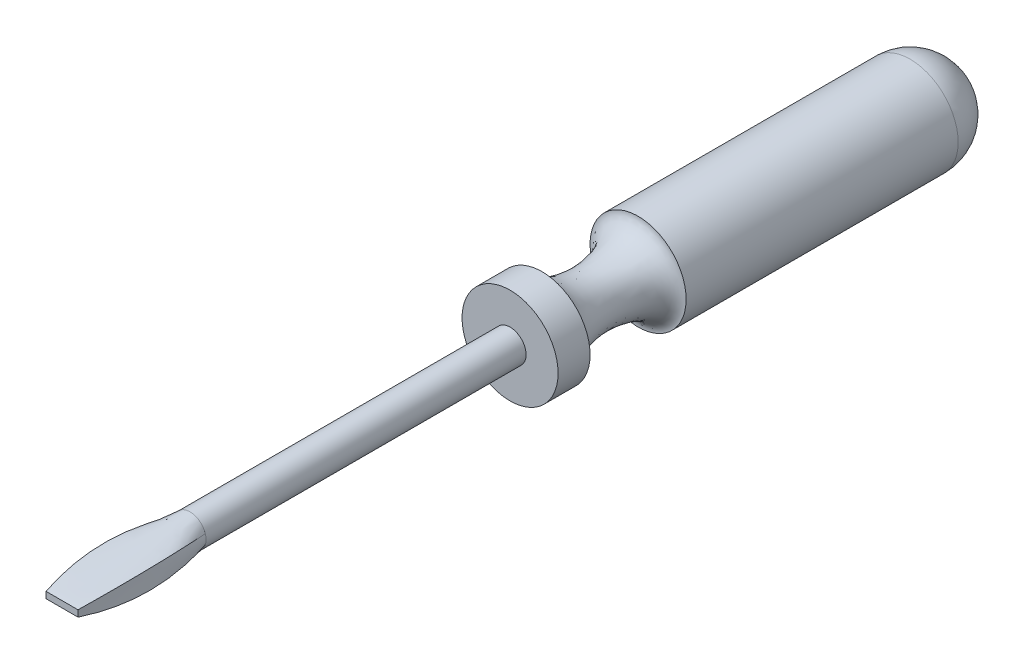
ISO-10303-21;
HEADER;
FILE_DESCRIPTION(('STEP AP214'),'2;1');
FILE_NAME('part.step','',(''),(''),'','','');
FILE_SCHEMA(('AUTOMOTIVE_DESIGN { 1 0 10303 214 1 1 1 1 }'));
ENDSEC;
DATA;
#1=APPLICATION_CONTEXT('core data for automotive mechanical design processes');
#2=APPLICATION_PROTOCOL_DEFINITION('international standard','automotive_design',2000,#1);
#3=PRODUCT_CONTEXT('',#1,'mechanical');
#4=PRODUCT('Part','Part','',(#3));
#5=PRODUCT_RELATED_PRODUCT_CATEGORY('part','',(#4));
#6=PRODUCT_DEFINITION_FORMATION('','',#4);
#7=PRODUCT_DEFINITION_CONTEXT('part definition',#1,'design');
#8=PRODUCT_DEFINITION('design','',#6,#7);
#9=PRODUCT_DEFINITION_SHAPE('','',#8);
#10=(LENGTH_UNIT() NAMED_UNIT(*) SI_UNIT(.MILLI.,.METRE.));
#11=(NAMED_UNIT(*) PLANE_ANGLE_UNIT() SI_UNIT($,.RADIAN.));
#12=(NAMED_UNIT(*) SI_UNIT($,.STERADIAN.) SOLID_ANGLE_UNIT());
#13=UNCERTAINTY_MEASURE_WITH_UNIT(LENGTH_MEASURE(1.E-05),#10,'distance_accuracy_value','');
#14=(GEOMETRIC_REPRESENTATION_CONTEXT(3) GLOBAL_UNCERTAINTY_ASSIGNED_CONTEXT((#13)) GLOBAL_UNIT_ASSIGNED_CONTEXT((#10,
#11,#12)) REPRESENTATION_CONTEXT('',''));
#15=CARTESIAN_POINT('',(0.,0.,0.));
#16=DIRECTION('',(0.,0.,1.));
#17=DIRECTION('',(1.,0.,0.));
#18=AXIS2_PLACEMENT_3D('',#15,#16,#17);
#19=CARTESIAN_POINT('',(0.,0.,0.));
#20=DIRECTION('',(0.,0.,1.));
#21=DIRECTION('',(1.,0.,0.));
#22=AXIS2_PLACEMENT_3D('',#19,#20,#21);
#23=PLANE('',#22);
#24=DIRECTION('',(0.,1.,0.));
#25=VECTOR('',#24,1.);
#26=CARTESIAN_POINT('',(6.35,1.27,0.));
#27=LINE('',#26,#25);
#28=CARTESIAN_POINT('',(6.35,-1.27,0.));
#29=VERTEX_POINT('',#28);
#30=CARTESIAN_POINT('',(6.35,1.27,0.));
#31=VERTEX_POINT('',#30);
#32=EDGE_CURVE('E214',#29,#31,#27,.T.);
#33=ORIENTED_EDGE('',*,*,#32,.T.);
#34=DIRECTION('',(-1.,0.,0.));
#35=VECTOR('',#34,1.);
#36=CARTESIAN_POINT('',(-6.35,1.27,0.));
#37=LINE('',#36,#35);
#38=CARTESIAN_POINT('',(-6.35,1.27,0.));
#39=VERTEX_POINT('',#38);
#40=EDGE_CURVE('E203',#31,#39,#37,.T.);
#41=ORIENTED_EDGE('',*,*,#40,.T.);
#42=DIRECTION('',(0.,-1.,0.));
#43=VECTOR('',#42,1.);
#44=CARTESIAN_POINT('',(-6.35,1.27,0.));
#45=LINE('',#44,#43);
#46=CARTESIAN_POINT('',(-6.35,-1.27,0.));
#47=VERTEX_POINT('',#46);
#48=EDGE_CURVE('E185',#39,#47,#45,.T.);
#49=ORIENTED_EDGE('',*,*,#48,.T.);
#50=DIRECTION('',(1.,0.,0.));
#51=VECTOR('',#50,1.);
#52=CARTESIAN_POINT('',(-6.35,-1.27,0.));
#53=LINE('',#52,#51);
#54=EDGE_CURVE('E296',#47,#29,#53,.T.);
#55=ORIENTED_EDGE('',*,*,#54,.T.);
#56=EDGE_LOOP('',(#33,#41,#49,#55));
#57=FACE_BOUND('',#56,.T.);
#58=ADVANCED_FACE('F119',(#57),#23,.T.);
#59=CARTESIAN_POINT('',(6.35,1.27,0.));
#60=CARTESIAN_POINT('',(8.09098283937438,2.86103718490474,-8.46270798454288));
#61=CARTESIAN_POINT('',(9.78431553948999,4.55437215944736,-25.3961706986833));
#62=CARTESIAN_POINT('',(7.90047388974248,3.27003054932142,-42.3293746512096));
#63=CARTESIAN_POINT('',(6.06423657555215,1.88349004662501,-50.8));
#64=CARTESIAN_POINT('',(6.35,0.423333333333333,0.));
#65=CARTESIAN_POINT('',(8.09098283937438,0.953679061634915,-8.46270798454288));
#66=CARTESIAN_POINT('',(9.59372399025767,1.50364915448665,-25.3961706986833));
#67=CARTESIAN_POINT('',(8.28148171467478,1.11894666889425,-42.3293746512096));
#68=CARTESIAN_POINT('',(6.44524440048445,0.656766501328776,-50.8));
#69=CARTESIAN_POINT('',(6.35,-0.423333333333334,0.));
#70=CARTESIAN_POINT('',(8.09098283937438,-0.953679061634913,-8.46270798454288));
#71=CARTESIAN_POINT('',(9.59372399025767,-1.50364915448665,-25.3961706986833));
#72=CARTESIAN_POINT('',(8.28148171467478,-1.11894666889425,-42.3293746512096));
#73=CARTESIAN_POINT('',(6.44524440048445,-0.65676650132878,-50.8));
#74=CARTESIAN_POINT('',(6.35,-1.27,0.));
#75=CARTESIAN_POINT('',(8.09098283937438,-2.86103718490474,-8.46270798454288));
#76=CARTESIAN_POINT('',(9.78431553948999,-4.55437215944735,-25.3961706986833));
#77=CARTESIAN_POINT('',(7.90047388974248,-3.27003054932142,-42.3293746512096));
#78=CARTESIAN_POINT('',(6.06423657555215,-1.88349004662502,-50.8));
#79=B_SPLINE_SURFACE_WITH_KNOTS('',3,3,((#59,#60,#61,#62,#63),(#64,#65,#66,#67,#68),(#69,#70,
#71,#72,#73),(#74,#75,#76,#77,#78)),.UNSPECIFIED.,.F.,.F.,.F.,(4,4),(4,1,4),(0.,1.),(0.,
0.50011498007058,1.),.UNSPECIFIED.);
#80=CARTESIAN_POINT('',(6.35,-1.27,0.));
#81=CARTESIAN_POINT('',(8.09098283937438,-2.86103718490474,-8.46270798454288));
#82=CARTESIAN_POINT('',(9.78431553948999,-4.55437215944735,-25.3961706986833));
#83=CARTESIAN_POINT('',(7.90047388974248,-3.27003054932142,-42.3293746512096));
#84=CARTESIAN_POINT('',(6.06423657555215,-1.88349004662502,-50.8));
#85=B_SPLINE_CURVE_WITH_KNOTS('',3,(#80,#81,#82,#83,#84),.UNSPECIFIED.,.F.,.F.,(4,1,4),(0.,
0.50011498007058,1.),.UNSPECIFIED.);
#86=CARTESIAN_POINT('',(6.0645397856654,-1.88358519058506,-50.8));
#87=VERTEX_POINT('',#86);
#88=EDGE_CURVE('E189',#29,#87,#85,.T.);
#89=CARTESIAN_POINT('',(0.,0.,-50.8));
#90=DIRECTION('',(0.,0.,1.));
#91=DIRECTION('',(1.,0.,0.));
#92=AXIS2_PLACEMENT_3D('',#89,#90,#91);
#93=CIRCLE('',#92,6.35);
#94=CARTESIAN_POINT('',(6.06451221628067,1.88357654908505,-50.8));
#95=VERTEX_POINT('',#94);
#96=EDGE_CURVE('E126',#87,#95,#93,.T.);
#97=CARTESIAN_POINT('',(6.35,1.27,0.));
#98=CARTESIAN_POINT('',(8.09098283937438,2.86103718490474,-8.46270798454288));
#99=CARTESIAN_POINT('',(9.78431553948999,4.55437215944736,-25.3961706986833));
#100=CARTESIAN_POINT('',(7.90047388974248,3.27003054932142,-42.3293746512096));
#101=CARTESIAN_POINT('',(6.06423657555215,1.88349004662501,-50.8));
#102=B_SPLINE_CURVE_WITH_KNOTS('',3,(#97,#98,#99,#100,#101),.UNSPECIFIED.,.F.,.F.,(4,1,4),(0.,
0.50011498007058,1.),.UNSPECIFIED.);
#103=EDGE_CURVE('E147',#95,#31,#102,.F.);
#104=ORIENTED_EDGE('',*,*,#32,.F.);
#105=ORIENTED_EDGE('',*,*,#88,.T.);
#106=ORIENTED_EDGE('',*,*,#96,.T.);
#107=ORIENTED_EDGE('',*,*,#103,.T.);
#108=EDGE_LOOP('',(#104,#105,#106,#107));
#109=FACE_BOUND('',#108,.T.);
#110=ADVANCED_FACE('F221',(#109),#79,.T.);
#111=CARTESIAN_POINT('',(6.35,-1.27,0.));
#112=CARTESIAN_POINT('',(8.09098283937438,-2.86103718490474,-8.46270798454288));
#113=CARTESIAN_POINT('',(9.78431553949,-4.55437215944736,-25.3961706986833));
#114=CARTESIAN_POINT('',(7.90047388974248,-3.27003054932142,-42.3293746512096));
#115=CARTESIAN_POINT('',(6.06423657555215,-1.88349004662502,-50.8));
#116=CARTESIAN_POINT('',(5.82083333333333,-1.27,0.));
#117=CARTESIAN_POINT('',(7.37656967394205,-2.75504928625989,-8.45321024073105));
#118=CARTESIAN_POINT('',(8.89957221242282,-4.43385460008674,-25.4056684434997));
#119=CARTESIAN_POINT('',(7.42093232332861,-3.61684528808901,-42.3198769073977));
#120=CARTESIAN_POINT('',(5.85804113848447,-2.54737351838447,-50.8));
#121=CARTESIAN_POINT('',(4.7625,-1.27,0.));
#122=CARTESIAN_POINT('',(5.94774334307739,-2.54307348897019,-8.4342147531074));
#123=CARTESIAN_POINT('',(7.23210386280418,-4.24609771557513,-25.4246639331324));
#124=CARTESIAN_POINT('',(6.25790640046964,-4.2039672934188,-42.300881419774));
#125=CARTESIAN_POINT('',(5.2417074743179,-3.76863298969801,-50.8));
#126=CARTESIAN_POINT('',(3.43958333333333,-1.27,0.));
#127=CARTESIAN_POINT('',(4.25336526489078,-2.34711738515885,-8.44514543418357));
#128=CARTESIAN_POINT('',(5.16931230338842,-4.0423102869184,-25.4137332509001));
#129=CARTESIAN_POINT('',(4.66948548773717,-4.80713068019484,-42.3118121008502));
#130=CARTESIAN_POINT('',(4.06203593613261,-4.959116769684,-50.7999999999999));
#131=CARTESIAN_POINT('',(2.38125,-1.27,0.));
#132=CARTESIAN_POINT('',(2.92371467758365,-2.23066752189838,-8.45412222317609));
#133=CARTESIAN_POINT('',(3.55920865650742,-3.92568919199222,-25.4047564609581));
#134=CARTESIAN_POINT('',(3.29269835402437,-5.1566084190962,-42.3207888898428));
#135=CARTESIAN_POINT('',(2.9350428536617,-5.65907860035766,-50.8000000000001));
#136=CARTESIAN_POINT('',(1.32291666666667,-1.27,0.));
#137=CARTESIAN_POINT('',(1.61085497517112,-2.14455951136192,-8.46307601311945));
#138=CARTESIAN_POINT('',(1.96342095127046,-3.83780479373293,-25.3958026700679));
#139=CARTESIAN_POINT('',(1.87051705532127,-5.41832523587702,-42.329742679786));
#140=CARTESIAN_POINT('',(1.71223348435848,-6.18054823227698,-50.7999999999999));
#141=CARTESIAN_POINT('',(0.,-1.27,0.));
#142=CARTESIAN_POINT('',(3.22301562987529E-05,-2.09798057840341,-8.46906940892825));
#143=CARTESIAN_POINT('',(3.22497012226451E-05,-3.7900727390932,-25.3898092736251));
#144=CARTESIAN_POINT('',(-9.66702680059693E-05,-5.56028155683576,-42.335736075595));
#145=CARTESIAN_POINT('',(-0.000193322838783379,-6.46351838530498,-50.8000000000002));
#146=CARTESIAN_POINT('',(-1.32291666666667,-1.27,0.));
#147=CARTESIAN_POINT('',(-1.61091783200104,-2.1445490988199,-8.46307739416093));
#148=CARTESIAN_POINT('',(-1.96348383556477,-3.83779408565037,-25.3958012890262));
#149=CARTESIAN_POINT('',(-1.87032854552465,-5.41835704516322,-42.3297440608275));
#150=CARTESIAN_POINT('',(-1.71185651781168,-6.18061152104128,-50.7999999999999));
#151=CARTESIAN_POINT('',(-2.38125,-1.27,0.));
#152=CARTESIAN_POINT('',(-2.92370458580723,-2.23066700155334,-8.45412218550851));
#153=CARTESIAN_POINT('',(-3.55919843428601,-3.92568875573983,-25.4047564986257));
#154=CARTESIAN_POINT('',(-3.29272887156439,-5.15660981106641,-42.3207888521753));
#155=CARTESIAN_POINT('',(-2.935103628648,-5.65908154799098,-50.8000000000001));
#156=CARTESIAN_POINT('',(-3.43958333333333,-1.27,0.));
#157=CARTESIAN_POINT('',(-4.25338972546873,-2.34710358282778,-8.44514667703548));
#158=CARTESIAN_POINT('',(-5.16933741344584,-4.04229591953955,-25.4137320080481));
#159=CARTESIAN_POINT('',(-4.66941085262581,-4.80717319138083,-42.3118133437021));
#160=CARTESIAN_POINT('',(-4.06188804313584,-4.95920080897503,-50.7999999999999));
#161=CARTESIAN_POINT('',(-4.7625,-1.27,0.));
#162=CARTESIAN_POINT('',(-5.94773057480386,-2.54308078297502,-8.43421407490754));
#163=CARTESIAN_POINT('',(-7.23208509401577,-4.24610854884719,-25.4246646113323));
#164=CARTESIAN_POINT('',(-6.2579566773203,-4.20393834953866,-42.3008807415742));
#165=CARTESIAN_POINT('',(-5.24179598211129,-3.76858211592939,-50.8));
#166=CARTESIAN_POINT('',(-5.82083333333333,-1.27,0.));
#167=CARTESIAN_POINT('',(-7.37656541785087,-2.75505171759484,-8.45321001466444));
#168=CARTESIAN_POINT('',(-8.89958071424489,-4.43384972831545,-25.4056686695663));
#169=CARTESIAN_POINT('',(-7.42091957968103,-3.61685259805183,-42.319876681331));
#170=CARTESIAN_POINT('',(-5.85804113848447,-2.54737351838447,-50.8));
#171=CARTESIAN_POINT('',(-6.35,-1.27,0.));
#172=CARTESIAN_POINT('',(-8.09098283937438,-2.86103718490474,-8.46270798454288));
#173=CARTESIAN_POINT('',(-9.78431553949,-4.55437215944736,-25.3961706986833));
#174=CARTESIAN_POINT('',(-7.90047388974248,-3.27003054932142,-42.3293746512096));
#175=CARTESIAN_POINT('',(-6.06423657555215,-1.88349004662501,-50.8));
#176=B_SPLINE_SURFACE_WITH_KNOTS('',3,3,((#111,#112,#113,#114,#115),(#116,#117,#118,#119,#120),
(#121,#122,#123,#124,#125),(#126,#127,#128,#129,#130),(#131,#132,#133,#134,#135),(#136,#137,
#138,#139,#140),(#141,#142,#143,#144,#145),(#146,#147,#148,#149,#150),(#151,#152,#153,#154,
#155),(#156,#157,#158,#159,#160),(#161,#162,#163,#164,#165),(#166,#167,#168,#169,#170),(#171,
#172,#173,#174,#175)),.UNSPECIFIED.,.F.,.F.,.F.,(4,1,1,1,1,1,1,1,1,1,4),(4,1,4),(0.,0.125,0.25,
0.3125,0.375,0.5,0.625,0.6875,0.75,0.875,1.),(0.,0.50011498007058,1.),.UNSPECIFIED.);
#177=CARTESIAN_POINT('',(-6.35,-1.27,0.));
#178=CARTESIAN_POINT('',(-8.09098283937438,-2.86103718490474,-8.46270798454288));
#179=CARTESIAN_POINT('',(-9.78431553949,-4.55437215944736,-25.3961706986833));
#180=CARTESIAN_POINT('',(-7.90047388974248,-3.27003054932142,-42.3293746512096));
#181=CARTESIAN_POINT('',(-6.06423657555215,-1.88349004662501,-50.8));
#182=B_SPLINE_CURVE_WITH_KNOTS('',3,(#177,#178,#179,#180,#181),.UNSPECIFIED.,.F.,.F.,(4,1,4),
(0.,0.50011498007058,1.),.UNSPECIFIED.);
#183=CARTESIAN_POINT('',(-6.06450627279449,-1.88357466201903,-50.8));
#184=VERTEX_POINT('',#183);
#185=EDGE_CURVE('E187',#47,#184,#182,.T.);
#186=EDGE_CURVE('E132',#184,#87,#93,.T.);
#187=ORIENTED_EDGE('',*,*,#54,.F.);
#188=ORIENTED_EDGE('',*,*,#185,.T.);
#189=ORIENTED_EDGE('',*,*,#186,.T.);
#190=ORIENTED_EDGE('',*,*,#88,.F.);
#191=EDGE_LOOP('',(#187,#188,#189,#190));
#192=FACE_BOUND('',#191,.T.);
#193=ADVANCED_FACE('F233',(#192),#176,.T.);
#194=CARTESIAN_POINT('',(-6.35,1.27,0.));
#195=CARTESIAN_POINT('',(-8.09098283937438,2.86103718490474,-8.46270798454288));
#196=CARTESIAN_POINT('',(-9.78431553949,4.55437215944736,-25.3961706986833));
#197=CARTESIAN_POINT('',(-7.90047388974248,3.27003054932142,-42.3293746512096));
#198=CARTESIAN_POINT('',(-6.06423657555215,1.88349004662501,-50.8));
#199=CARTESIAN_POINT('',(-5.82083333333333,1.27,0.));
#200=CARTESIAN_POINT('',(-7.37656967394205,2.75504928625989,-8.45321024073105));
#201=CARTESIAN_POINT('',(-8.89957221242282,4.43385460008674,-25.4056684434997));
#202=CARTESIAN_POINT('',(-7.4209323233286,3.616845288089,-42.3198769073977));
#203=CARTESIAN_POINT('',(-5.85804113848447,2.54737351838447,-50.8));
#204=CARTESIAN_POINT('',(-4.7625,1.27,0.));
#205=CARTESIAN_POINT('',(-5.94774334307739,2.54307348897019,-8.4342147531074));
#206=CARTESIAN_POINT('',(-7.23210386280418,4.24609771557512,-25.4246639331323));
#207=CARTESIAN_POINT('',(-6.25790640046964,4.20396729341881,-42.3008814197742));
#208=CARTESIAN_POINT('',(-5.2417074743179,3.76863298969801,-50.8000000000001));
#209=CARTESIAN_POINT('',(-3.43958333333333,1.27,0.));
#210=CARTESIAN_POINT('',(-4.25336526489078,2.34711738515885,-8.44514543418357));
#211=CARTESIAN_POINT('',(-5.16931230338842,4.04231028691841,-25.4137332509002));
#212=CARTESIAN_POINT('',(-4.66948548773717,4.80713068019483,-42.3118121008501));
#213=CARTESIAN_POINT('',(-4.06203593613262,4.959116769684,-50.7999999999999));
#214=CARTESIAN_POINT('',(-2.38125,1.27,0.));
#215=CARTESIAN_POINT('',(-2.92371467758365,2.23066752189839,-8.45412222317609));
#216=CARTESIAN_POINT('',(-3.55920865650741,3.92568919199222,-25.4047564609581));
#217=CARTESIAN_POINT('',(-3.29269835402438,5.15660841909619,-42.3207888898428));
#218=CARTESIAN_POINT('',(-2.9350428536617,5.65907860035765,-50.8000000000001));
#219=CARTESIAN_POINT('',(-1.32291666666667,1.27,0.));
#220=CARTESIAN_POINT('',(-1.61085497517112,2.14455951136192,-8.46307601311945));
#221=CARTESIAN_POINT('',(-1.96342095127046,3.83780479373293,-25.3958026700679));
#222=CARTESIAN_POINT('',(-1.87051705532127,5.41832523587703,-42.329742679786));
#223=CARTESIAN_POINT('',(-1.71223348435848,6.18054823227698,-50.7999999999999));
#224=CARTESIAN_POINT('',(0.,1.27,0.));
#225=CARTESIAN_POINT('',(-3.22301562974964E-05,2.09798057840341,-8.46906940892825));
#226=CARTESIAN_POINT('',(-3.2249701221856E-05,3.79007273909321,-25.3898092736251));
#227=CARTESIAN_POINT('',(9.66702680031364E-05,5.56028155683575,-42.335736075595));
#228=CARTESIAN_POINT('',(0.00019332283877709,6.46351838530498,-50.8000000000001));
#229=CARTESIAN_POINT('',(1.32291666666667,1.27,0.));
#230=CARTESIAN_POINT('',(1.61091783200104,2.14454909881991,-8.46307739416093));
#231=CARTESIAN_POINT('',(1.96348383556477,3.83779408565037,-25.3958012890262));
#232=CARTESIAN_POINT('',(1.87032854552465,5.41835704516323,-42.3297440608276));
#233=CARTESIAN_POINT('',(1.71185651781168,6.18061152104128,-50.7999999999999));
#234=CARTESIAN_POINT('',(2.38125,1.27,0.));
#235=CARTESIAN_POINT('',(2.92370458580723,2.23066700155334,-8.45412218550851));
#236=CARTESIAN_POINT('',(3.55919843428601,3.92568875573983,-25.4047564986257));
#237=CARTESIAN_POINT('',(3.29272887156439,5.15660981106642,-42.3207888521752));
#238=CARTESIAN_POINT('',(2.93510362864799,5.65908154799099,-50.8000000000001));
#239=CARTESIAN_POINT('',(3.43958333333333,1.27,0.));
#240=CARTESIAN_POINT('',(4.25338972546873,2.34710358282779,-8.44514667703548));
#241=CARTESIAN_POINT('',(5.16933741344583,4.04229591953955,-25.4137320080481));
#242=CARTESIAN_POINT('',(4.66941085262581,4.80717319138083,-42.3118133437022));
#243=CARTESIAN_POINT('',(4.06188804313585,4.95920080897502,-50.7999999999999));
#244=CARTESIAN_POINT('',(4.7625,1.27,0.));
#245=CARTESIAN_POINT('',(5.94773057480386,2.54308078297502,-8.43421407490754));
#246=CARTESIAN_POINT('',(7.23208509401577,4.24610854884719,-25.4246646113323));
#247=CARTESIAN_POINT('',(6.25795667732029,4.20393834953867,-42.3008807415742));
#248=CARTESIAN_POINT('',(5.24179598211128,3.76858211592941,-50.8));
#249=CARTESIAN_POINT('',(5.82083333333333,1.27,0.));
#250=CARTESIAN_POINT('',(7.37656541785087,2.75505171759483,-8.45321001466444));
#251=CARTESIAN_POINT('',(8.8995807142449,4.43384972831545,-25.4056686695663));
#252=CARTESIAN_POINT('',(7.42091957968103,3.61685259805183,-42.3198766813311));
#253=CARTESIAN_POINT('',(5.85804113848447,2.54737351838447,-50.8));
#254=CARTESIAN_POINT('',(6.35,1.27,0.));
#255=CARTESIAN_POINT('',(8.09098283937438,2.86103718490474,-8.46270798454288));
#256=CARTESIAN_POINT('',(9.78431553949,4.55437215944736,-25.3961706986833));
#257=CARTESIAN_POINT('',(7.90047388974248,3.27003054932142,-42.3293746512096));
#258=CARTESIAN_POINT('',(6.06423657555215,1.88349004662501,-50.8));
#259=B_SPLINE_SURFACE_WITH_KNOTS('',3,3,((#194,#195,#196,#197,#198),(#199,#200,#201,#202,#203),
(#204,#205,#206,#207,#208),(#209,#210,#211,#212,#213),(#214,#215,#216,#217,#218),(#219,#220,
#221,#222,#223),(#224,#225,#226,#227,#228),(#229,#230,#231,#232,#233),(#234,#235,#236,#237,
#238),(#239,#240,#241,#242,#243),(#244,#245,#246,#247,#248),(#249,#250,#251,#252,#253),(#254,
#255,#256,#257,#258)),.UNSPECIFIED.,.F.,.F.,.F.,(4,1,1,1,1,1,1,1,1,1,4),(4,1,4),(0.,0.125,0.25,
0.3125,0.375,0.5,0.625,0.6875,0.75,0.875,1.),(0.,0.50011498007058,1.),.UNSPECIFIED.);
#260=CARTESIAN_POINT('',(-6.06454574900313,1.88358708694687,-50.8));
#261=VERTEX_POINT('',#260);
#262=EDGE_CURVE('E167',#95,#261,#93,.T.);
#263=CARTESIAN_POINT('',(-6.35,1.27,0.));
#264=CARTESIAN_POINT('',(-8.09098283937438,2.86103718490474,-8.46270798454288));
#265=CARTESIAN_POINT('',(-9.78431553949,4.55437215944736,-25.3961706986833));
#266=CARTESIAN_POINT('',(-7.90047388974248,3.27003054932142,-42.3293746512096));
#267=CARTESIAN_POINT('',(-6.06423657555215,1.88349004662501,-50.8));
#268=B_SPLINE_CURVE_WITH_KNOTS('',3,(#263,#264,#265,#266,#267),.UNSPECIFIED.,.F.,.F.,(4,1,4),
(0.,0.50011498007058,1.),.UNSPECIFIED.);
#269=EDGE_CURVE('E181',#39,#261,#268,.T.);
#270=ORIENTED_EDGE('',*,*,#40,.F.);
#271=ORIENTED_EDGE('',*,*,#103,.F.);
#272=ORIENTED_EDGE('',*,*,#262,.T.);
#273=ORIENTED_EDGE('',*,*,#269,.F.);
#274=EDGE_LOOP('',(#270,#271,#272,#273));
#275=FACE_BOUND('',#274,.T.);
#276=ADVANCED_FACE('F180',(#275),#259,.T.);
#277=CARTESIAN_POINT('',(-6.35,-1.27,0.));
#278=CARTESIAN_POINT('',(-8.09098283937438,-2.86103718490474,-8.46270798454288));
#279=CARTESIAN_POINT('',(-9.78431553949,-4.55437215944735,-25.3961706986833));
#280=CARTESIAN_POINT('',(-7.90047388974248,-3.27003054932142,-42.3293746512096));
#281=CARTESIAN_POINT('',(-6.06423657555215,-1.88349004662501,-50.8));
#282=CARTESIAN_POINT('',(-6.35,-0.423333333333334,0.));
#283=CARTESIAN_POINT('',(-8.09098283937438,-0.953679061634913,-8.46270798454288));
#284=CARTESIAN_POINT('',(-9.59372399025768,-1.50364915448665,-25.3961706986833));
#285=CARTESIAN_POINT('',(-8.28148171467478,-1.11894666889424,-42.3293746512096));
#286=CARTESIAN_POINT('',(-6.44524440048445,-0.656766501328776,-50.8));
#287=CARTESIAN_POINT('',(-6.35,0.423333333333333,0.));
#288=CARTESIAN_POINT('',(-8.09098283937438,0.953679061634914,-8.46270798454288));
#289=CARTESIAN_POINT('',(-9.59372399025767,1.50364915448665,-25.3961706986833));
#290=CARTESIAN_POINT('',(-8.28148171467478,1.11894666889425,-42.3293746512096));
#291=CARTESIAN_POINT('',(-6.44524440048445,0.656766501328778,-50.8));
#292=CARTESIAN_POINT('',(-6.35,1.27,0.));
#293=CARTESIAN_POINT('',(-8.09098283937438,2.86103718490474,-8.46270798454288));
#294=CARTESIAN_POINT('',(-9.78431553949,4.55437215944736,-25.3961706986833));
#295=CARTESIAN_POINT('',(-7.90047388974248,3.27003054932142,-42.3293746512096));
#296=CARTESIAN_POINT('',(-6.06423657555215,1.88349004662501,-50.8));
#297=B_SPLINE_SURFACE_WITH_KNOTS('',3,3,((#277,#278,#279,#280,#281),(#282,#283,#284,#285,#286),
(#287,#288,#289,#290,#291),(#292,#293,#294,#295,#296)),.UNSPECIFIED.,.F.,.F.,.F.,(4,4),(4,1,4),
(0.,1.),(0.,0.50011498007058,1.),.UNSPECIFIED.);
#298=EDGE_CURVE('E12',#261,#184,#93,.T.);
#299=ORIENTED_EDGE('',*,*,#48,.F.);
#300=ORIENTED_EDGE('',*,*,#269,.T.);
#301=ORIENTED_EDGE('',*,*,#298,.T.);
#302=ORIENTED_EDGE('',*,*,#185,.F.);
#303=EDGE_LOOP('',(#299,#300,#301,#302));
#304=FACE_BOUND('',#303,.T.);
#305=ADVANCED_FACE('F121',(#304),#297,.T.);
#306=CARTESIAN_POINT('',(0.,0.,-177.8));
#307=DIRECTION('',(0.,0.,1.));
#308=DIRECTION('',(1.,0.,0.));
#309=AXIS2_PLACEMENT_3D('',#306,#307,#308);
#310=CYLINDRICAL_SURFACE('',#309,6.35);
#311=CARTESIAN_POINT('',(0.,0.,-177.8));
#312=DIRECTION('',(0.,0.,-1.));
#313=DIRECTION('',(-1.,0.,0.));
#314=AXIS2_PLACEMENT_3D('',#311,#312,#313);
#315=CIRCLE('',#314,6.35);
#316=CARTESIAN_POINT('',(-6.35,0.,-177.8));
#317=VERTEX_POINT('',#316);
#318=EDGE_CURVE('E307',#317,#317,#315,.T.);
#319=ORIENTED_EDGE('',*,*,#318,.F.);
#320=EDGE_LOOP('',(#319));
#321=FACE_BOUND('',#320,.T.);
#322=ORIENTED_EDGE('',*,*,#262,.F.);
#323=ORIENTED_EDGE('',*,*,#96,.F.);
#324=ORIENTED_EDGE('',*,*,#186,.F.);
#325=ORIENTED_EDGE('',*,*,#298,.F.);
#326=EDGE_LOOP('',(#322,#323,#324,#325));
#327=FACE_BOUND('',#326,.T.);
#328=ADVANCED_FACE('F166',(#321,#327),#310,.T.);
#329=CARTESIAN_POINT('',(0.,0.,-177.8));
#330=DIRECTION('',(0.,0.,-1.));
#331=DIRECTION('',(-1.,0.,0.));
#332=AXIS2_PLACEMENT_3D('',#329,#330,#331);
#333=PLANE('',#332);
#334=ORIENTED_EDGE('',*,*,#318,.T.);
#335=EDGE_LOOP('',(#334));
#336=FACE_BOUND('',#335,.T.);
#337=CARTESIAN_POINT('',(0.,0.,-177.8));
#338=DIRECTION('',(0.,0.,1.));
#339=DIRECTION('',(1.,0.,0.));
#340=AXIS2_PLACEMENT_3D('',#337,#338,#339);
#341=CIRCLE('',#340,19.05);
#342=CARTESIAN_POINT('',(19.05,0.,-177.8));
#343=VERTEX_POINT('',#342);
#344=EDGE_CURVE('E476',#343,#343,#341,.T.);
#345=ORIENTED_EDGE('',*,*,#344,.T.);
#346=EDGE_LOOP('',(#345));
#347=FACE_BOUND('',#346,.T.);
#348=ADVANCED_FACE('F360',(#336,#347),#333,.F.);
#349=CARTESIAN_POINT('',(0.,0.,-336.55));
#350=DIRECTION('',(0.,0.,1.));
#351=DIRECTION('',(0.,1.,0.));
#352=AXIS2_PLACEMENT_3D('',#349,#350,#351);
#353=SPHERICAL_SURFACE('',#352,19.0500000000001);
#354=CARTESIAN_POINT('',(0.,0.,-336.55));
#355=DIRECTION('',(0.,0.,1.));
#356=DIRECTION('',(1.,0.,0.));
#357=AXIS2_PLACEMENT_3D('',#354,#355,#356);
#358=CIRCLE('',#357,19.0500000000001);
#359=CARTESIAN_POINT('',(19.0500000000001,0.,-336.55));
#360=VERTEX_POINT('',#359);
#361=EDGE_CURVE('E485',#360,#360,#358,.T.);
#362=ORIENTED_EDGE('',*,*,#361,.F.);
#363=EDGE_LOOP('',(#362));
#364=FACE_BOUND('',#363,.T.);
#365=ADVANCED_FACE('F367',(#364),#353,.T.);
#366=CARTESIAN_POINT('',(0.,0.,56.5273304676157));
#367=DIRECTION('',(0.,0.,1.));
#368=DIRECTION('',(1.,0.,0.));
#369=AXIS2_PLACEMENT_3D('',#366,#367,#368);
#370=CYLINDRICAL_SURFACE('',#369,19.0500000000001);
#371=CARTESIAN_POINT('',(0.,0.,-228.6));
#372=DIRECTION('',(0.,0.,1.));
#373=DIRECTION('',(1.,0.,0.));
#374=AXIS2_PLACEMENT_3D('',#371,#372,#373);
#375=CIRCLE('',#374,19.05);
#376=CARTESIAN_POINT('',(19.05,0.,-228.6));
#377=VERTEX_POINT('',#376);
#378=EDGE_CURVE('E482',#377,#377,#375,.T.);
#379=ORIENTED_EDGE('',*,*,#378,.F.);
#380=EDGE_LOOP('',(#379));
#381=FACE_BOUND('',#380,.T.);
#382=ORIENTED_EDGE('',*,*,#361,.T.);
#383=EDGE_LOOP('',(#382));
#384=FACE_BOUND('',#383,.T.);
#385=ADVANCED_FACE('F375',(#381,#384),#370,.T.);
#386=CARTESIAN_POINT('',(0.,19.05,-209.55));
#387=DIRECTION('',(-1.,0.,0.));
#388=DIRECTION('',(0.,0.,-1.));
#389=AXIS2_PLACEMENT_3D('',#386,#387,#388);
#390=ELLIPSE('',#389,19.05,8.89);
#391=CARTESIAN_POINT('',(0.,0.,56.5273304676157));
#392=DIRECTION('',(0.,0.,1.));
#393=AXIS1_PLACEMENT('',#391,#392);
#394=SURFACE_OF_REVOLUTION('',#390,#393);
#395=CARTESIAN_POINT('',(0.,0.,-190.5));
#396=DIRECTION('',(0.,0.,1.));
#397=DIRECTION('',(1.,0.,0.));
#398=AXIS2_PLACEMENT_3D('',#395,#396,#397);
#399=CIRCLE('',#398,19.05);
#400=CARTESIAN_POINT('',(19.05,0.,-190.5));
#401=VERTEX_POINT('',#400);
#402=EDGE_CURVE('E479',#401,#401,#399,.T.);
#403=ORIENTED_EDGE('',*,*,#402,.F.);
#404=EDGE_LOOP('',(#403));
#405=FACE_BOUND('',#404,.T.);
#406=ORIENTED_EDGE('',*,*,#378,.T.);
#407=EDGE_LOOP('',(#406));
#408=FACE_BOUND('',#407,.T.);
#409=ADVANCED_FACE('F383',(#405,#408),#394,.T.);
#410=CARTESIAN_POINT('',(0.,0.,56.5273304676157));
#411=DIRECTION('',(0.,0.,1.));
#412=DIRECTION('',(1.,0.,0.));
#413=AXIS2_PLACEMENT_3D('',#410,#411,#412);
#414=CYLINDRICAL_SURFACE('',#413,19.05);
#415=ORIENTED_EDGE('',*,*,#344,.F.);
#416=EDGE_LOOP('',(#415));
#417=FACE_BOUND('',#416,.T.);
#418=ORIENTED_EDGE('',*,*,#402,.T.);
#419=EDGE_LOOP('',(#418));
#420=FACE_BOUND('',#419,.T.);
#421=ADVANCED_FACE('F391',(#417,#420),#414,.T.);
#422=CLOSED_SHELL('',(#58,#110,#193,#276,#305,#328,#348,#365,#385,#409,#421));
#423=MANIFOLD_SOLID_BREP('B2',#422);
#424=ADVANCED_BREP_SHAPE_REPRESENTATION('',(#18,#423),#14);
#425=SHAPE_DEFINITION_REPRESENTATION(#9,#424);
ENDSEC;
END-ISO-10303-21;
